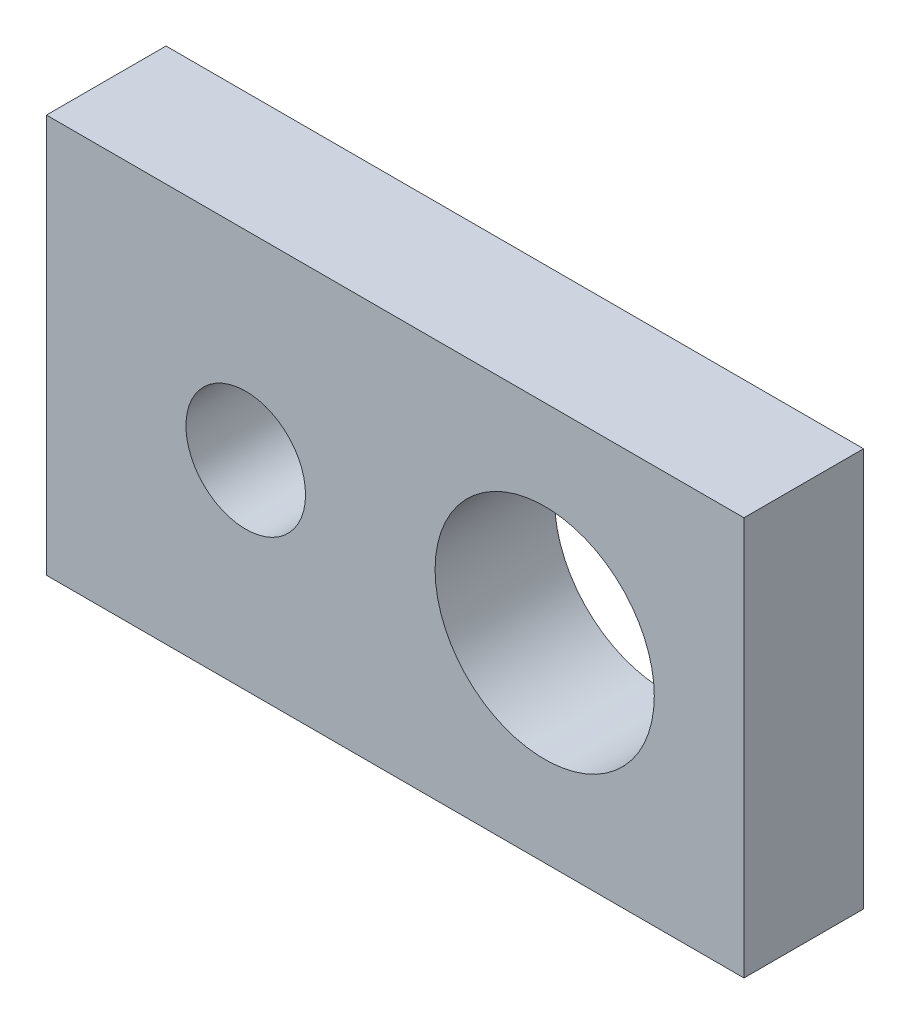
ISO-10303-21;
HEADER;
FILE_DESCRIPTION(('STEP AP214'),'2;1');
FILE_NAME('part.step','',(''),(''),'','','');
FILE_SCHEMA(('AUTOMOTIVE_DESIGN { 1 0 10303 214 1 1 1 1 }'));
ENDSEC;
DATA;
#1=APPLICATION_CONTEXT('core data for automotive mechanical design processes');
#2=APPLICATION_PROTOCOL_DEFINITION('international standard','automotive_design',2000,#1);
#3=PRODUCT_CONTEXT('',#1,'mechanical');
#4=PRODUCT('Part','Part','',(#3));
#5=PRODUCT_RELATED_PRODUCT_CATEGORY('part','',(#4));
#6=PRODUCT_DEFINITION_FORMATION('','',#4);
#7=PRODUCT_DEFINITION_CONTEXT('part definition',#1,'design');
#8=PRODUCT_DEFINITION('design','',#6,#7);
#9=PRODUCT_DEFINITION_SHAPE('','',#8);
#10=(LENGTH_UNIT() NAMED_UNIT(*) SI_UNIT(.MILLI.,.METRE.));
#11=(NAMED_UNIT(*) PLANE_ANGLE_UNIT() SI_UNIT($,.RADIAN.));
#12=(NAMED_UNIT(*) SI_UNIT($,.STERADIAN.) SOLID_ANGLE_UNIT());
#13=UNCERTAINTY_MEASURE_WITH_UNIT(LENGTH_MEASURE(1.E-05),#10,'distance_accuracy_value','');
#14=(GEOMETRIC_REPRESENTATION_CONTEXT(3) GLOBAL_UNCERTAINTY_ASSIGNED_CONTEXT((#13)) GLOBAL_UNIT_ASSIGNED_CONTEXT((#10,
#11,#12)) REPRESENTATION_CONTEXT('',''));
#15=CARTESIAN_POINT('',(0.,0.,0.));
#16=DIRECTION('',(0.,0.,1.));
#17=DIRECTION('',(1.,0.,0.));
#18=AXIS2_PLACEMENT_3D('',#15,#16,#17);
#19=CARTESIAN_POINT('',(0.,-10.,6.));
#20=DIRECTION('',(0.,1.,0.));
#21=DIRECTION('',(0.,0.,1.));
#22=AXIS2_PLACEMENT_3D('',#19,#20,#21);
#23=PLANE('',#22);
#24=DIRECTION('',(1.,0.,0.));
#25=VECTOR('',#24,1.);
#26=CARTESIAN_POINT('',(0.,-10.,0.));
#27=LINE('',#26,#25);
#28=CARTESIAN_POINT('',(-17.5,-10.,0.));
#29=VERTEX_POINT('',#28);
#30=CARTESIAN_POINT('',(17.5,-10.,0.));
#31=VERTEX_POINT('',#30);
#32=EDGE_CURVE('E124',#29,#31,#27,.T.);
#33=ORIENTED_EDGE('',*,*,#32,.T.);
#34=DIRECTION('',(0.,0.,-1.));
#35=VECTOR('',#34,1.);
#36=CARTESIAN_POINT('',(17.5,-10.,6.));
#37=LINE('',#36,#35);
#38=CARTESIAN_POINT('',(17.5,-10.,6.));
#39=VERTEX_POINT('',#38);
#40=EDGE_CURVE('E11',#39,#31,#37,.T.);
#41=ORIENTED_EDGE('',*,*,#40,.F.);
#42=DIRECTION('',(1.,0.,0.));
#43=VECTOR('',#42,1.);
#44=CARTESIAN_POINT('',(0.,-10.,6.));
#45=LINE('',#44,#43);
#46=CARTESIAN_POINT('',(-17.5,-10.,6.));
#47=VERTEX_POINT('',#46);
#48=EDGE_CURVE('E98',#47,#39,#45,.T.);
#49=ORIENTED_EDGE('',*,*,#48,.F.);
#50=DIRECTION('',(0.,0.,-1.));
#51=VECTOR('',#50,1.);
#52=CARTESIAN_POINT('',(-17.5,-10.,6.));
#53=LINE('',#52,#51);
#54=EDGE_CURVE('E65',#47,#29,#53,.T.);
#55=ORIENTED_EDGE('',*,*,#54,.T.);
#56=EDGE_LOOP('',(#33,#41,#49,#55));
#57=FACE_BOUND('',#56,.T.);
#58=ADVANCED_FACE('F47',(#57),#23,.F.);
#59=CARTESIAN_POINT('',(17.5,0.,6.));
#60=DIRECTION('',(-1.,0.,0.));
#61=DIRECTION('',(0.,-1.,0.));
#62=AXIS2_PLACEMENT_3D('',#59,#60,#61);
#63=PLANE('',#62);
#64=DIRECTION('',(0.,1.,0.));
#65=VECTOR('',#64,1.);
#66=CARTESIAN_POINT('',(17.5,0.,0.));
#67=LINE('',#66,#65);
#68=CARTESIAN_POINT('',(17.5,10.,0.));
#69=VERTEX_POINT('',#68);
#70=EDGE_CURVE('E104',#31,#69,#67,.T.);
#71=ORIENTED_EDGE('',*,*,#70,.T.);
#72=DIRECTION('',(0.,0.,-1.));
#73=VECTOR('',#72,1.);
#74=CARTESIAN_POINT('',(17.5,10.,6.));
#75=LINE('',#74,#73);
#76=CARTESIAN_POINT('',(17.5,10.,6.));
#77=VERTEX_POINT('',#76);
#78=EDGE_CURVE('E57',#77,#69,#75,.T.);
#79=ORIENTED_EDGE('',*,*,#78,.F.);
#80=DIRECTION('',(0.,1.,0.));
#81=VECTOR('',#80,1.);
#82=CARTESIAN_POINT('',(17.5,0.,6.));
#83=LINE('',#82,#81);
#84=EDGE_CURVE('E90',#39,#77,#83,.T.);
#85=ORIENTED_EDGE('',*,*,#84,.F.);
#86=ORIENTED_EDGE('',*,*,#40,.T.);
#87=EDGE_LOOP('',(#71,#79,#85,#86));
#88=FACE_BOUND('',#87,.T.);
#89=ADVANCED_FACE('F103',(#88),#63,.F.);
#90=CARTESIAN_POINT('',(0.,10.,6.));
#91=DIRECTION('',(0.,1.,0.));
#92=DIRECTION('',(-1.,0.,0.));
#93=AXIS2_PLACEMENT_3D('',#90,#91,#92);
#94=PLANE('',#93);
#95=DIRECTION('',(1.,0.,0.));
#96=VECTOR('',#95,1.);
#97=CARTESIAN_POINT('',(0.,10.,0.));
#98=LINE('',#97,#96);
#99=CARTESIAN_POINT('',(-17.5,10.,0.));
#100=VERTEX_POINT('',#99);
#101=EDGE_CURVE('E129',#100,#69,#98,.T.);
#102=ORIENTED_EDGE('',*,*,#101,.F.);
#103=DIRECTION('',(0.,0.,-1.));
#104=VECTOR('',#103,1.);
#105=CARTESIAN_POINT('',(-17.5,10.,6.));
#106=LINE('',#105,#104);
#107=CARTESIAN_POINT('',(-17.5,10.,6.));
#108=VERTEX_POINT('',#107);
#109=EDGE_CURVE('E79',#108,#100,#106,.T.);
#110=ORIENTED_EDGE('',*,*,#109,.F.);
#111=DIRECTION('',(1.,0.,0.));
#112=VECTOR('',#111,1.);
#113=CARTESIAN_POINT('',(0.,10.,6.));
#114=LINE('',#113,#112);
#115=EDGE_CURVE('E97',#108,#77,#114,.T.);
#116=ORIENTED_EDGE('',*,*,#115,.T.);
#117=ORIENTED_EDGE('',*,*,#78,.T.);
#118=EDGE_LOOP('',(#102,#110,#116,#117));
#119=FACE_BOUND('',#118,.T.);
#120=ADVANCED_FACE('F108',(#119),#94,.T.);
#121=CARTESIAN_POINT('',(-7.5,0.,6.));
#122=DIRECTION('',(0.,0.,-1.));
#123=DIRECTION('',(-1.,0.,0.));
#124=AXIS2_PLACEMENT_3D('',#121,#122,#123);
#125=CYLINDRICAL_SURFACE('',#124,3.);
#126=CARTESIAN_POINT('',(-7.5,0.,6.));
#127=DIRECTION('',(0.,0.,1.));
#128=DIRECTION('',(1.,0.,0.));
#129=AXIS2_PLACEMENT_3D('',#126,#127,#128);
#130=CIRCLE('',#129,3.);
#131=CARTESIAN_POINT('',(-4.5,0.,6.));
#132=VERTEX_POINT('',#131);
#133=EDGE_CURVE('E143',#132,#132,#130,.T.);
#134=ORIENTED_EDGE('',*,*,#133,.T.);
#135=EDGE_LOOP('',(#134));
#136=FACE_BOUND('',#135,.T.);
#137=CARTESIAN_POINT('',(-7.5,0.,0.));
#138=DIRECTION('',(0.,0.,1.));
#139=DIRECTION('',(1.,0.,0.));
#140=AXIS2_PLACEMENT_3D('',#137,#138,#139);
#141=CIRCLE('',#140,3.);
#142=CARTESIAN_POINT('',(-4.5,0.,0.));
#143=VERTEX_POINT('',#142);
#144=EDGE_CURVE('E120',#143,#143,#141,.T.);
#145=ORIENTED_EDGE('',*,*,#144,.F.);
#146=EDGE_LOOP('',(#145));
#147=FACE_BOUND('',#146,.T.);
#148=ADVANCED_FACE('F153',(#136,#147),#125,.F.);
#149=CARTESIAN_POINT('',(7.5,0.,6.));
#150=DIRECTION('',(0.,0.,-1.));
#151=DIRECTION('',(-1.,0.,0.));
#152=AXIS2_PLACEMENT_3D('',#149,#150,#151);
#153=CYLINDRICAL_SURFACE('',#152,5.5);
#154=CARTESIAN_POINT('',(7.5,0.,6.));
#155=DIRECTION('',(0.,0.,1.));
#156=DIRECTION('',(1.,0.,0.));
#157=AXIS2_PLACEMENT_3D('',#154,#155,#156);
#158=CIRCLE('',#157,5.5);
#159=CARTESIAN_POINT('',(13.,0.,6.));
#160=VERTEX_POINT('',#159);
#161=EDGE_CURVE('E136',#160,#160,#158,.T.);
#162=ORIENTED_EDGE('',*,*,#161,.T.);
#163=EDGE_LOOP('',(#162));
#164=FACE_BOUND('',#163,.T.);
#165=CARTESIAN_POINT('',(7.5,0.,0.));
#166=DIRECTION('',(0.,0.,1.));
#167=DIRECTION('',(1.,0.,0.));
#168=AXIS2_PLACEMENT_3D('',#165,#166,#167);
#169=CIRCLE('',#168,5.5);
#170=CARTESIAN_POINT('',(13.,0.,0.));
#171=VERTEX_POINT('',#170);
#172=EDGE_CURVE('E116',#171,#171,#169,.T.);
#173=ORIENTED_EDGE('',*,*,#172,.F.);
#174=EDGE_LOOP('',(#173));
#175=FACE_BOUND('',#174,.T.);
#176=ADVANCED_FACE('F49',(#164,#175),#153,.F.);
#177=CARTESIAN_POINT('',(-17.5,0.,6.));
#178=DIRECTION('',(-1.,0.,0.));
#179=DIRECTION('',(0.,-1.,0.));
#180=AXIS2_PLACEMENT_3D('',#177,#178,#179);
#181=PLANE('',#180);
#182=DIRECTION('',(0.,1.,0.));
#183=VECTOR('',#182,1.);
#184=CARTESIAN_POINT('',(-17.5,0.,0.));
#185=LINE('',#184,#183);
#186=EDGE_CURVE('E132',#29,#100,#185,.T.);
#187=ORIENTED_EDGE('',*,*,#186,.F.);
#188=ORIENTED_EDGE('',*,*,#54,.F.);
#189=DIRECTION('',(0.,1.,0.));
#190=VECTOR('',#189,1.);
#191=CARTESIAN_POINT('',(-17.5,0.,6.));
#192=LINE('',#191,#190);
#193=EDGE_CURVE('E110',#47,#108,#192,.T.);
#194=ORIENTED_EDGE('',*,*,#193,.T.);
#195=ORIENTED_EDGE('',*,*,#109,.T.);
#196=EDGE_LOOP('',(#187,#188,#194,#195));
#197=FACE_BOUND('',#196,.T.);
#198=ADVANCED_FACE('F158',(#197),#181,.T.);
#199=CARTESIAN_POINT('',(0.,0.,6.));
#200=DIRECTION('',(0.,0.,1.));
#201=DIRECTION('',(1.,0.,0.));
#202=AXIS2_PLACEMENT_3D('',#199,#200,#201);
#203=PLANE('',#202);
#204=ORIENTED_EDGE('',*,*,#161,.F.);
#205=EDGE_LOOP('',(#204));
#206=FACE_BOUND('',#205,.T.);
#207=ORIENTED_EDGE('',*,*,#133,.F.);
#208=EDGE_LOOP('',(#207));
#209=FACE_BOUND('',#208,.T.);
#210=ORIENTED_EDGE('',*,*,#48,.T.);
#211=ORIENTED_EDGE('',*,*,#84,.T.);
#212=ORIENTED_EDGE('',*,*,#115,.F.);
#213=ORIENTED_EDGE('',*,*,#193,.F.);
#214=EDGE_LOOP('',(#210,#211,#212,#213));
#215=FACE_BOUND('',#214,.T.);
#216=ADVANCED_FACE('F94',(#206,#209,#215),#203,.T.);
#217=CARTESIAN_POINT('',(0.,0.,0.));
#218=DIRECTION('',(0.,0.,1.));
#219=DIRECTION('',(1.,0.,0.));
#220=AXIS2_PLACEMENT_3D('',#217,#218,#219);
#221=PLANE('',#220);
#222=ORIENTED_EDGE('',*,*,#172,.T.);
#223=EDGE_LOOP('',(#222));
#224=FACE_BOUND('',#223,.T.);
#225=ORIENTED_EDGE('',*,*,#144,.T.);
#226=EDGE_LOOP('',(#225));
#227=FACE_BOUND('',#226,.T.);
#228=ORIENTED_EDGE('',*,*,#32,.F.);
#229=ORIENTED_EDGE('',*,*,#186,.T.);
#230=ORIENTED_EDGE('',*,*,#101,.T.);
#231=ORIENTED_EDGE('',*,*,#70,.F.);
#232=EDGE_LOOP('',(#228,#229,#230,#231));
#233=FACE_BOUND('',#232,.T.);
#234=ADVANCED_FACE('F157',(#224,#227,#233),#221,.F.);
#235=CLOSED_SHELL('',(#58,#89,#120,#148,#176,#198,#216,#234));
#236=MANIFOLD_SOLID_BREP('B2',#235);
#237=ADVANCED_BREP_SHAPE_REPRESENTATION('',(#18,#236),#14);
#238=SHAPE_DEFINITION_REPRESENTATION(#9,#237);
ENDSEC;
END-ISO-10303-21;
